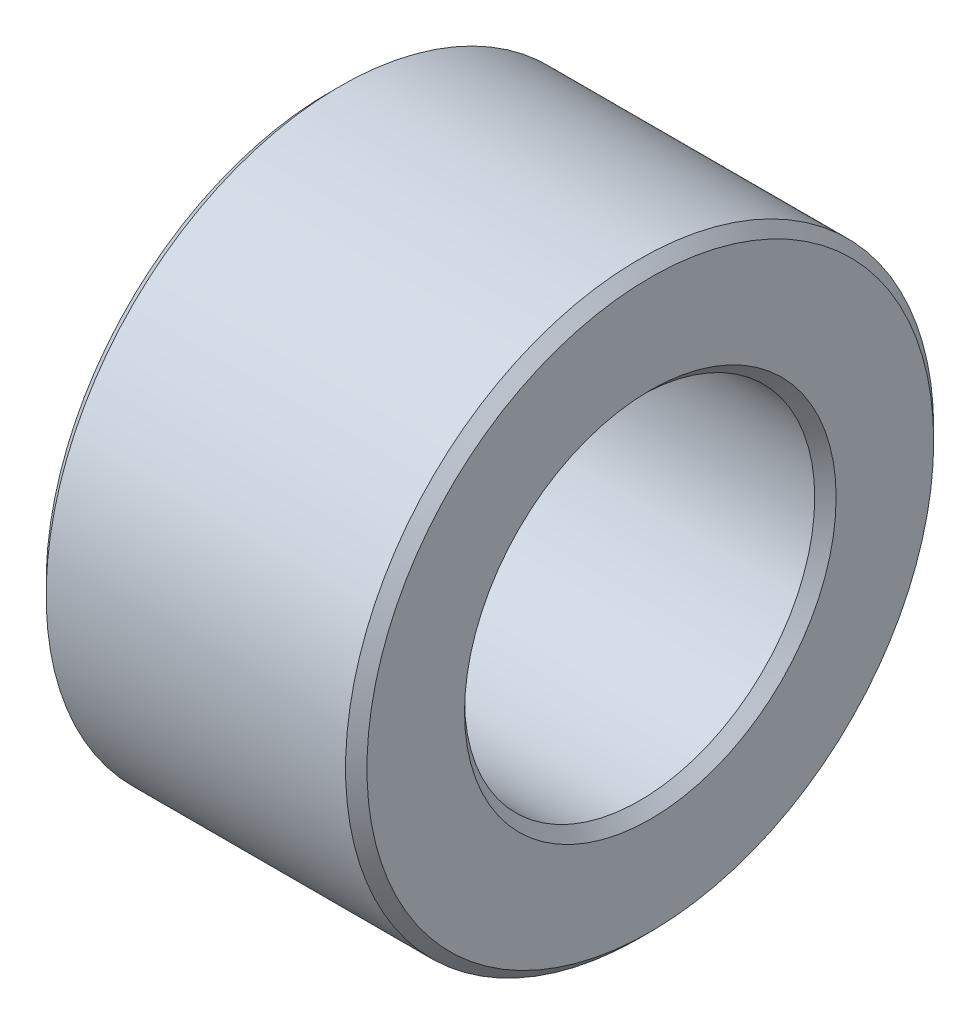
ISO-10303-21;
HEADER;
FILE_DESCRIPTION(('STEP AP214'),'2;1');
FILE_NAME('part.step','',(''),(''),'','','');
FILE_SCHEMA(('AUTOMOTIVE_DESIGN { 1 0 10303 214 1 1 1 1 }'));
ENDSEC;
DATA;
#1=APPLICATION_CONTEXT('core data for automotive mechanical design processes');
#2=APPLICATION_PROTOCOL_DEFINITION('international standard','automotive_design',2000,#1);
#3=PRODUCT_CONTEXT('',#1,'mechanical');
#4=PRODUCT('Part','Part','',(#3));
#5=PRODUCT_RELATED_PRODUCT_CATEGORY('part','',(#4));
#6=PRODUCT_DEFINITION_FORMATION('','',#4);
#7=PRODUCT_DEFINITION_CONTEXT('part definition',#1,'design');
#8=PRODUCT_DEFINITION('design','',#6,#7);
#9=PRODUCT_DEFINITION_SHAPE('','',#8);
#10=(LENGTH_UNIT() NAMED_UNIT(*) SI_UNIT(.MILLI.,.METRE.));
#11=(NAMED_UNIT(*) PLANE_ANGLE_UNIT() SI_UNIT($,.RADIAN.));
#12=(NAMED_UNIT(*) SI_UNIT($,.STERADIAN.) SOLID_ANGLE_UNIT());
#13=UNCERTAINTY_MEASURE_WITH_UNIT(LENGTH_MEASURE(1.E-05),#10,'distance_accuracy_value','');
#14=(GEOMETRIC_REPRESENTATION_CONTEXT(3) GLOBAL_UNCERTAINTY_ASSIGNED_CONTEXT((#13)) GLOBAL_UNIT_ASSIGNED_CONTEXT((#10,
#11,#12)) REPRESENTATION_CONTEXT('',''));
#15=CARTESIAN_POINT('',(0.,0.,0.));
#16=DIRECTION('',(0.,0.,1.));
#17=DIRECTION('',(1.,0.,0.));
#18=AXIS2_PLACEMENT_3D('',#15,#16,#17);
#19=CARTESIAN_POINT('',(-30.,0.,0.));
#20=DIRECTION('',(1.,0.,0.));
#21=DIRECTION('',(0.,0.,-1.));
#22=AXIS2_PLACEMENT_3D('',#19,#20,#21);
#23=CYLINDRICAL_SURFACE('',#22,55.);
#24=CARTESIAN_POINT('',(-28.,0.,0.));
#25=DIRECTION('',(1.,0.,0.));
#26=DIRECTION('',(0.,0.,-1.));
#27=AXIS2_PLACEMENT_3D('',#24,#25,#26);
#28=CIRCLE('',#27,55.);
#29=CARTESIAN_POINT('',(-28.,0.,-55.));
#30=VERTEX_POINT('',#29);
#31=EDGE_CURVE('E60',#30,#30,#28,.T.);
#32=ORIENTED_EDGE('',*,*,#31,.T.);
#33=EDGE_LOOP('',(#32));
#34=FACE_BOUND('',#33,.T.);
#35=CARTESIAN_POINT('',(28.,0.,0.));
#36=DIRECTION('',(1.,0.,0.));
#37=DIRECTION('',(0.,0.,-1.));
#38=AXIS2_PLACEMENT_3D('',#35,#36,#37);
#39=CIRCLE('',#38,55.);
#40=CARTESIAN_POINT('',(28.,0.,-55.));
#41=VERTEX_POINT('',#40);
#42=EDGE_CURVE('E63',#41,#41,#39,.F.);
#43=ORIENTED_EDGE('',*,*,#42,.T.);
#44=EDGE_LOOP('',(#43));
#45=FACE_BOUND('',#44,.T.);
#46=ADVANCED_FACE('F34',(#34,#45),#23,.T.);
#47=CARTESIAN_POINT('',(-30.,0.,0.));
#48=DIRECTION('',(1.,0.,0.));
#49=DIRECTION('',(0.,0.,-1.));
#50=AXIS2_PLACEMENT_3D('',#47,#48,#49);
#51=PLANE('',#50);
#52=CARTESIAN_POINT('',(-30.,0.,0.));
#53=DIRECTION('',(1.,0.,0.));
#54=DIRECTION('',(0.,0.,-1.));
#55=AXIS2_PLACEMENT_3D('',#52,#53,#54);
#56=CIRCLE('',#55,34.75);
#57=CARTESIAN_POINT('',(-30.,0.,-34.75));
#58=VERTEX_POINT('',#57);
#59=EDGE_CURVE('E49',#58,#58,#56,.T.);
#60=ORIENTED_EDGE('',*,*,#59,.T.);
#61=EDGE_LOOP('',(#60));
#62=FACE_BOUND('',#61,.T.);
#63=CARTESIAN_POINT('',(-30.,0.,0.));
#64=DIRECTION('',(1.,0.,0.));
#65=DIRECTION('',(0.,0.,-1.));
#66=AXIS2_PLACEMENT_3D('',#63,#64,#65);
#67=CIRCLE('',#66,53.);
#68=CARTESIAN_POINT('',(-30.,0.,-53.));
#69=VERTEX_POINT('',#68);
#70=EDGE_CURVE('E57',#69,#69,#67,.F.);
#71=ORIENTED_EDGE('',*,*,#70,.T.);
#72=EDGE_LOOP('',(#71));
#73=FACE_BOUND('',#72,.T.);
#74=ADVANCED_FACE('F79',(#62,#73),#51,.F.);
#75=CARTESIAN_POINT('',(30.,0.,0.));
#76=DIRECTION('',(1.,0.,0.));
#77=DIRECTION('',(0.,0.,-1.));
#78=AXIS2_PLACEMENT_3D('',#75,#76,#77);
#79=PLANE('',#78);
#80=CARTESIAN_POINT('',(30.,0.,0.));
#81=DIRECTION('',(1.,0.,0.));
#82=DIRECTION('',(0.,0.,-1.));
#83=AXIS2_PLACEMENT_3D('',#80,#81,#82);
#84=CIRCLE('',#83,34.75);
#85=CARTESIAN_POINT('',(30.,0.,-34.75));
#86=VERTEX_POINT('',#85);
#87=EDGE_CURVE('E10',#86,#86,#84,.F.);
#88=ORIENTED_EDGE('',*,*,#87,.T.);
#89=EDGE_LOOP('',(#88));
#90=FACE_BOUND('',#89,.T.);
#91=CARTESIAN_POINT('',(30.,0.,0.));
#92=DIRECTION('',(1.,0.,0.));
#93=DIRECTION('',(0.,0.,-1.));
#94=AXIS2_PLACEMENT_3D('',#91,#92,#93);
#95=CIRCLE('',#94,53.);
#96=CARTESIAN_POINT('',(30.,0.,-53.));
#97=VERTEX_POINT('',#96);
#98=EDGE_CURVE('E54',#97,#97,#95,.T.);
#99=ORIENTED_EDGE('',*,*,#98,.T.);
#100=EDGE_LOOP('',(#99));
#101=FACE_BOUND('',#100,.T.);
#102=ADVANCED_FACE('F76',(#90,#101),#79,.T.);
#103=CARTESIAN_POINT('',(-30.,0.,0.));
#104=DIRECTION('',(1.,0.,0.));
#105=DIRECTION('',(0.,0.,-1.));
#106=AXIS2_PLACEMENT_3D('',#103,#104,#105);
#107=CYLINDRICAL_SURFACE('',#106,32.75);
#108=CARTESIAN_POINT('',(-28.,0.,0.));
#109=DIRECTION('',(1.,0.,0.));
#110=DIRECTION('',(0.,0.,-1.));
#111=AXIS2_PLACEMENT_3D('',#108,#109,#110);
#112=CIRCLE('',#111,32.75);
#113=CARTESIAN_POINT('',(-28.,0.,-32.75));
#114=VERTEX_POINT('',#113);
#115=EDGE_CURVE('E41',#114,#114,#112,.F.);
#116=ORIENTED_EDGE('',*,*,#115,.T.);
#117=EDGE_LOOP('',(#116));
#118=FACE_BOUND('',#117,.T.);
#119=CARTESIAN_POINT('',(28.,0.,0.));
#120=DIRECTION('',(1.,0.,0.));
#121=DIRECTION('',(0.,0.,-1.));
#122=AXIS2_PLACEMENT_3D('',#119,#120,#121);
#123=CIRCLE('',#122,32.75);
#124=CARTESIAN_POINT('',(28.,0.,-32.75));
#125=VERTEX_POINT('',#124);
#126=EDGE_CURVE('E45',#125,#125,#123,.T.);
#127=ORIENTED_EDGE('',*,*,#126,.T.);
#128=EDGE_LOOP('',(#127));
#129=FACE_BOUND('',#128,.T.);
#130=ADVANCED_FACE('F78',(#118,#129),#107,.F.);
#131=CARTESIAN_POINT('',(-28.,0.,0.));
#132=DIRECTION('',(1.,0.,0.));
#133=DIRECTION('',(0.,0.,-1.));
#134=AXIS2_PLACEMENT_3D('',#131,#132,#133);
#135=CONICAL_SURFACE('',#134,55.,0.785398163397448);
#136=ORIENTED_EDGE('',*,*,#70,.F.);
#137=EDGE_LOOP('',(#136));
#138=FACE_BOUND('',#137,.T.);
#139=ORIENTED_EDGE('',*,*,#31,.F.);
#140=EDGE_LOOP('',(#139));
#141=FACE_BOUND('',#140,.T.);
#142=ADVANCED_FACE('F72',(#138,#141),#135,.T.);
#143=CARTESIAN_POINT('',(30.,0.,0.));
#144=DIRECTION('',(-1.,0.,0.));
#145=DIRECTION('',(0.,0.,1.));
#146=AXIS2_PLACEMENT_3D('',#143,#144,#145);
#147=CONICAL_SURFACE('',#146,53.,0.785398163397448);
#148=ORIENTED_EDGE('',*,*,#42,.F.);
#149=EDGE_LOOP('',(#148));
#150=FACE_BOUND('',#149,.T.);
#151=ORIENTED_EDGE('',*,*,#98,.F.);
#152=EDGE_LOOP('',(#151));
#153=FACE_BOUND('',#152,.T.);
#154=ADVANCED_FACE('F68',(#150,#153),#147,.T.);
#155=CARTESIAN_POINT('',(-30.,0.,0.));
#156=DIRECTION('',(-1.,0.,0.));
#157=DIRECTION('',(0.,0.,1.));
#158=AXIS2_PLACEMENT_3D('',#155,#156,#157);
#159=CONICAL_SURFACE('',#158,34.75,0.785398163397443);
#160=ORIENTED_EDGE('',*,*,#115,.F.);
#161=EDGE_LOOP('',(#160));
#162=FACE_BOUND('',#161,.T.);
#163=ORIENTED_EDGE('',*,*,#59,.F.);
#164=EDGE_LOOP('',(#163));
#165=FACE_BOUND('',#164,.T.);
#166=ADVANCED_FACE('F71',(#162,#165),#159,.F.);
#167=CARTESIAN_POINT('',(28.,0.,0.));
#168=DIRECTION('',(1.,0.,0.));
#169=DIRECTION('',(0.,0.,-1.));
#170=AXIS2_PLACEMENT_3D('',#167,#168,#169);
#171=CONICAL_SURFACE('',#170,32.75,0.785398163397448);
#172=ORIENTED_EDGE('',*,*,#87,.F.);
#173=EDGE_LOOP('',(#172));
#174=FACE_BOUND('',#173,.T.);
#175=ORIENTED_EDGE('',*,*,#126,.F.);
#176=EDGE_LOOP('',(#175));
#177=FACE_BOUND('',#176,.T.);
#178=ADVANCED_FACE('F36',(#174,#177),#171,.F.);
#179=CLOSED_SHELL('',(#46,#74,#102,#130,#142,#154,#166,#178));
#180=MANIFOLD_SOLID_BREP('B2',#179);
#181=ADVANCED_BREP_SHAPE_REPRESENTATION('',(#18,#180),#14);
#182=SHAPE_DEFINITION_REPRESENTATION(#9,#181);
ENDSEC;
END-ISO-10303-21;
